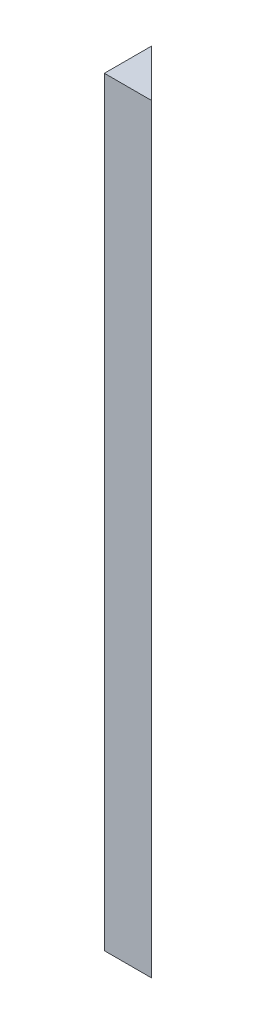
ISO-10303-21;
HEADER;
FILE_DESCRIPTION(('STEP AP214'),'2;1');
FILE_NAME('part.step','',(''),(''),'','','');
FILE_SCHEMA(('AUTOMOTIVE_DESIGN { 1 0 10303 214 1 1 1 1 }'));
ENDSEC;
DATA;
#1=APPLICATION_CONTEXT('core data for automotive mechanical design processes');
#2=APPLICATION_PROTOCOL_DEFINITION('international standard','automotive_design',2000,#1);
#3=PRODUCT_CONTEXT('',#1,'mechanical');
#4=PRODUCT('Part','Part','',(#3));
#5=PRODUCT_RELATED_PRODUCT_CATEGORY('part','',(#4));
#6=PRODUCT_DEFINITION_FORMATION('','',#4);
#7=PRODUCT_DEFINITION_CONTEXT('part definition',#1,'design');
#8=PRODUCT_DEFINITION('design','',#6,#7);
#9=PRODUCT_DEFINITION_SHAPE('','',#8);
#10=(LENGTH_UNIT() NAMED_UNIT(*) SI_UNIT(.MILLI.,.METRE.));
#11=(NAMED_UNIT(*) PLANE_ANGLE_UNIT() SI_UNIT($,.RADIAN.));
#12=(NAMED_UNIT(*) SI_UNIT($,.STERADIAN.) SOLID_ANGLE_UNIT());
#13=UNCERTAINTY_MEASURE_WITH_UNIT(LENGTH_MEASURE(1.E-05),#10,'distance_accuracy_value','');
#14=(GEOMETRIC_REPRESENTATION_CONTEXT(3) GLOBAL_UNCERTAINTY_ASSIGNED_CONTEXT((#13)) GLOBAL_UNIT_ASSIGNED_CONTEXT((#10,
#11,#12)) REPRESENTATION_CONTEXT('',''));
#15=CARTESIAN_POINT('',(0.,0.,0.));
#16=DIRECTION('',(0.,0.,1.));
#17=DIRECTION('',(1.,0.,0.));
#18=AXIS2_PLACEMENT_3D('',#15,#16,#17);
#19=CARTESIAN_POINT('',(0.,182.,-11.3099999999999));
#20=DIRECTION('',(1.,0.,0.));
#21=DIRECTION('',(0.,0.,-1.));
#22=AXIS2_PLACEMENT_3D('',#19,#20,#21);
#23=PLANE('',#22);
#24=DIRECTION('',(0.,0.,1.));
#25=VECTOR('',#24,1.);
#26=CARTESIAN_POINT('',(0.,0.,-11.3099999999999));
#27=LINE('',#26,#25);
#28=CARTESIAN_POINT('',(0.,0.,-11.3099999999999));
#29=VERTEX_POINT('',#28);
#30=CARTESIAN_POINT('',(0.,0.,0.));
#31=VERTEX_POINT('',#30);
#32=EDGE_CURVE('E79',#29,#31,#27,.T.);
#33=ORIENTED_EDGE('',*,*,#32,.T.);
#34=DIRECTION('',(0.,-1.,0.));
#35=VECTOR('',#34,1.);
#36=CARTESIAN_POINT('',(0.,182.,0.));
#37=LINE('',#36,#35);
#38=CARTESIAN_POINT('',(0.,182.,0.));
#39=VERTEX_POINT('',#38);
#40=EDGE_CURVE('E11',#39,#31,#37,.T.);
#41=ORIENTED_EDGE('',*,*,#40,.F.);
#42=DIRECTION('',(0.,0.,1.));
#43=VECTOR('',#42,1.);
#44=CARTESIAN_POINT('',(0.,182.,-11.3099999999999));
#45=LINE('',#44,#43);
#46=CARTESIAN_POINT('',(0.,182.,-11.3099999999999));
#47=VERTEX_POINT('',#46);
#48=EDGE_CURVE('E72',#47,#39,#45,.T.);
#49=ORIENTED_EDGE('',*,*,#48,.F.);
#50=DIRECTION('',(0.,-1.,0.));
#51=VECTOR('',#50,1.);
#52=CARTESIAN_POINT('',(0.,182.,-11.3099999999999));
#53=LINE('',#52,#51);
#54=EDGE_CURVE('E80',#47,#29,#53,.T.);
#55=ORIENTED_EDGE('',*,*,#54,.T.);
#56=EDGE_LOOP('',(#33,#41,#49,#55));
#57=FACE_BOUND('',#56,.T.);
#58=ADVANCED_FACE('F32',(#57),#23,.F.);
#59=CARTESIAN_POINT('',(0.,182.,0.));
#60=DIRECTION('',(0.,0.,-1.));
#61=DIRECTION('',(-1.,0.,0.));
#62=AXIS2_PLACEMENT_3D('',#59,#60,#61);
#63=PLANE('',#62);
#64=DIRECTION('',(1.,0.,0.));
#65=VECTOR('',#64,1.);
#66=CARTESIAN_POINT('',(0.,0.,0.));
#67=LINE('',#66,#65);
#68=CARTESIAN_POINT('',(11.31,0.,0.));
#69=VERTEX_POINT('',#68);
#70=EDGE_CURVE('E60',#31,#69,#67,.T.);
#71=ORIENTED_EDGE('',*,*,#70,.T.);
#72=DIRECTION('',(0.,-1.,0.));
#73=VECTOR('',#72,1.);
#74=CARTESIAN_POINT('',(11.31,182.,0.));
#75=LINE('',#74,#73);
#76=CARTESIAN_POINT('',(11.31,182.,0.));
#77=VERTEX_POINT('',#76);
#78=EDGE_CURVE('E40',#77,#69,#75,.T.);
#79=ORIENTED_EDGE('',*,*,#78,.F.);
#80=DIRECTION('',(1.,0.,0.));
#81=VECTOR('',#80,1.);
#82=CARTESIAN_POINT('',(0.,182.,0.));
#83=LINE('',#82,#81);
#84=EDGE_CURVE('E68',#39,#77,#83,.T.);
#85=ORIENTED_EDGE('',*,*,#84,.F.);
#86=ORIENTED_EDGE('',*,*,#40,.T.);
#87=EDGE_LOOP('',(#71,#79,#85,#86));
#88=FACE_BOUND('',#87,.T.);
#89=ADVANCED_FACE('F69',(#88),#63,.F.);
#90=CARTESIAN_POINT('',(11.31,182.,0.));
#91=DIRECTION('',(-0.707106781186544,0.,0.707106781186551));
#92=DIRECTION('',(0.707106781186551,0.,0.707106781186544));
#93=AXIS2_PLACEMENT_3D('',#90,#91,#92);
#94=PLANE('',#93);
#95=DIRECTION('',(-0.707106781186551,0.,-0.707106781186544));
#96=VECTOR('',#95,1.);
#97=CARTESIAN_POINT('',(11.31,0.,0.));
#98=LINE('',#97,#96);
#99=EDGE_CURVE('E65',#69,#29,#98,.T.);
#100=ORIENTED_EDGE('',*,*,#99,.T.);
#101=ORIENTED_EDGE('',*,*,#54,.F.);
#102=DIRECTION('',(-0.707106781186551,0.,-0.707106781186544));
#103=VECTOR('',#102,1.);
#104=CARTESIAN_POINT('',(11.31,182.,0.));
#105=LINE('',#104,#103);
#106=EDGE_CURVE('E48',#77,#47,#105,.T.);
#107=ORIENTED_EDGE('',*,*,#106,.F.);
#108=ORIENTED_EDGE('',*,*,#78,.T.);
#109=EDGE_LOOP('',(#100,#101,#107,#108));
#110=FACE_BOUND('',#109,.T.);
#111=ADVANCED_FACE('F87',(#110),#94,.F.);
#112=CARTESIAN_POINT('',(0.,182.,0.));
#113=DIRECTION('',(0.,1.,0.));
#114=DIRECTION('',(0.,0.,1.));
#115=AXIS2_PLACEMENT_3D('',#112,#113,#114);
#116=PLANE('',#115);
#117=ORIENTED_EDGE('',*,*,#48,.T.);
#118=ORIENTED_EDGE('',*,*,#84,.T.);
#119=ORIENTED_EDGE('',*,*,#106,.T.);
#120=EDGE_LOOP('',(#117,#118,#119));
#121=FACE_BOUND('',#120,.T.);
#122=ADVANCED_FACE('F75',(#121),#116,.T.);
#123=CARTESIAN_POINT('',(0.,0.,0.));
#124=DIRECTION('',(0.,1.,0.));
#125=DIRECTION('',(0.,0.,1.));
#126=AXIS2_PLACEMENT_3D('',#123,#124,#125);
#127=PLANE('',#126);
#128=ORIENTED_EDGE('',*,*,#32,.F.);
#129=ORIENTED_EDGE('',*,*,#99,.F.);
#130=ORIENTED_EDGE('',*,*,#70,.F.);
#131=EDGE_LOOP('',(#128,#129,#130));
#132=FACE_BOUND('',#131,.T.);
#133=ADVANCED_FACE('F88',(#132),#127,.F.);
#134=CLOSED_SHELL('',(#58,#89,#111,#122,#133));
#135=MANIFOLD_SOLID_BREP('B2',#134);
#136=ADVANCED_BREP_SHAPE_REPRESENTATION('',(#18,#135),#14);
#137=SHAPE_DEFINITION_REPRESENTATION(#9,#136);
ENDSEC;
END-ISO-10303-21;
